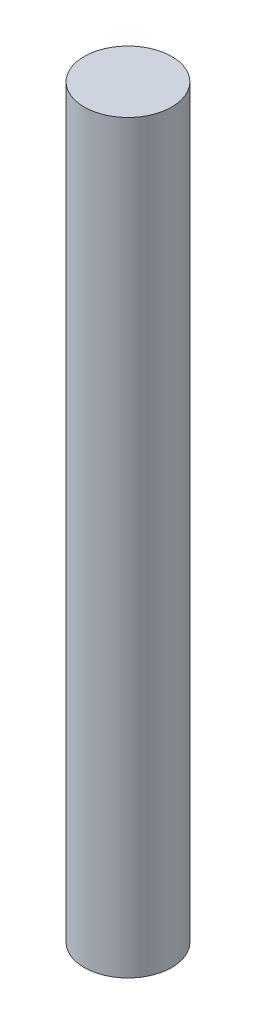
ISO-10303-21;
HEADER;
FILE_DESCRIPTION(('STEP AP214'),'2;1');
FILE_NAME('part.step','',(''),(''),'','','');
FILE_SCHEMA(('AUTOMOTIVE_DESIGN { 1 0 10303 214 1 1 1 1 }'));
ENDSEC;
DATA;
#1=APPLICATION_CONTEXT('core data for automotive mechanical design processes');
#2=APPLICATION_PROTOCOL_DEFINITION('international standard','automotive_design',2000,#1);
#3=PRODUCT_CONTEXT('',#1,'mechanical');
#4=PRODUCT('Part','Part','',(#3));
#5=PRODUCT_RELATED_PRODUCT_CATEGORY('part','',(#4));
#6=PRODUCT_DEFINITION_FORMATION('','',#4);
#7=PRODUCT_DEFINITION_CONTEXT('part definition',#1,'design');
#8=PRODUCT_DEFINITION('design','',#6,#7);
#9=PRODUCT_DEFINITION_SHAPE('','',#8);
#10=(LENGTH_UNIT() NAMED_UNIT(*) SI_UNIT(.MILLI.,.METRE.));
#11=(NAMED_UNIT(*) PLANE_ANGLE_UNIT() SI_UNIT($,.RADIAN.));
#12=(NAMED_UNIT(*) SI_UNIT($,.STERADIAN.) SOLID_ANGLE_UNIT());
#13=UNCERTAINTY_MEASURE_WITH_UNIT(LENGTH_MEASURE(1.E-05),#10,'distance_accuracy_value','');
#14=(GEOMETRIC_REPRESENTATION_CONTEXT(3) GLOBAL_UNCERTAINTY_ASSIGNED_CONTEXT((#13)) GLOBAL_UNIT_ASSIGNED_CONTEXT((#10,
#11,#12)) REPRESENTATION_CONTEXT('',''));
#15=CARTESIAN_POINT('',(0.,0.,0.));
#16=DIRECTION('',(0.,0.,1.));
#17=DIRECTION('',(1.,0.,0.));
#18=AXIS2_PLACEMENT_3D('',#15,#16,#17);
#19=CARTESIAN_POINT('',(0.,0.,0.));
#20=DIRECTION('',(0.,1.,0.));
#21=DIRECTION('',(0.,0.,1.));
#22=AXIS2_PLACEMENT_3D('',#19,#20,#21);
#23=PLANE('',#22);
#24=CARTESIAN_POINT('',(0.,0.,0.));
#25=DIRECTION('',(0.,1.,0.));
#26=DIRECTION('',(0.,0.,1.));
#27=AXIS2_PLACEMENT_3D('',#24,#25,#26);
#28=CIRCLE('',#27,5.875);
#29=CARTESIAN_POINT('',(0.,0.,5.875));
#30=VERTEX_POINT('',#29);
#31=EDGE_CURVE('E11',#30,#30,#28,.T.);
#32=ORIENTED_EDGE('',*,*,#31,.F.);
#33=EDGE_LOOP('',(#32));
#34=FACE_BOUND('',#33,.T.);
#35=CARTESIAN_POINT('',(0.,0.,0.));
#36=DIRECTION('',(0.,1.,0.));
#37=DIRECTION('',(0.,0.,1.));
#38=AXIS2_PLACEMENT_3D('',#35,#36,#37);
#39=CIRCLE('',#38,2.59);
#40=CARTESIAN_POINT('',(-1.5,0.,-2.1114213222377));
#41=VERTEX_POINT('',#40);
#42=CARTESIAN_POINT('',(1.5,0.,-2.1114213222377));
#43=VERTEX_POINT('',#42);
#44=EDGE_CURVE('E65',#41,#43,#39,.T.);
#45=ORIENTED_EDGE('',*,*,#44,.T.);
#46=DIRECTION('',(-1.,0.,0.));
#47=VECTOR('',#46,1.);
#48=CARTESIAN_POINT('',(-1.5,0.,-2.1114213222377));
#49=LINE('',#48,#47);
#50=EDGE_CURVE('E75',#43,#41,#49,.T.);
#51=ORIENTED_EDGE('',*,*,#50,.T.);
#52=EDGE_LOOP('',(#45,#51));
#53=FACE_BOUND('',#52,.T.);
#54=ADVANCED_FACE('F42',(#34,#53),#23,.F.);
#55=CARTESIAN_POINT('',(0.,20.,0.));
#56=DIRECTION('',(0.,-1.,0.));
#57=DIRECTION('',(0.,0.,-1.));
#58=AXIS2_PLACEMENT_3D('',#55,#56,#57);
#59=CYLINDRICAL_SURFACE('',#58,5.875);
#60=ORIENTED_EDGE('',*,*,#31,.T.);
#61=EDGE_LOOP('',(#60));
#62=FACE_BOUND('',#61,.T.);
#63=CARTESIAN_POINT('',(0.,100.,0.));
#64=DIRECTION('',(0.,1.,0.));
#65=DIRECTION('',(0.,0.,1.));
#66=AXIS2_PLACEMENT_3D('',#63,#64,#65);
#67=CIRCLE('',#66,5.875);
#68=CARTESIAN_POINT('',(0.,100.,5.875));
#69=VERTEX_POINT('',#68);
#70=EDGE_CURVE('E91',#69,#69,#67,.T.);
#71=ORIENTED_EDGE('',*,*,#70,.F.);
#72=EDGE_LOOP('',(#71));
#73=FACE_BOUND('',#72,.T.);
#74=ADVANCED_FACE('F44',(#62,#73),#59,.T.);
#75=CARTESIAN_POINT('',(0.,20.,0.));
#76=DIRECTION('',(0.,-1.,0.));
#77=DIRECTION('',(0.,0.,-1.));
#78=AXIS2_PLACEMENT_3D('',#75,#76,#77);
#79=CYLINDRICAL_SURFACE('',#78,2.59);
#80=ORIENTED_EDGE('',*,*,#44,.F.);
#81=DIRECTION('',(0.,-1.,0.));
#82=VECTOR('',#81,1.);
#83=CARTESIAN_POINT('',(-1.5,20.,-2.1114213222377));
#84=LINE('',#83,#82);
#85=CARTESIAN_POINT('',(-1.5,20.,-2.1114213222377));
#86=VERTEX_POINT('',#85);
#87=EDGE_CURVE('E79',#86,#41,#84,.T.);
#88=ORIENTED_EDGE('',*,*,#87,.F.);
#89=CARTESIAN_POINT('',(0.,20.,0.));
#90=DIRECTION('',(0.,1.,0.));
#91=DIRECTION('',(0.,0.,1.));
#92=AXIS2_PLACEMENT_3D('',#89,#90,#91);
#93=CIRCLE('',#92,2.59);
#94=CARTESIAN_POINT('',(1.5,20.,-2.1114213222377));
#95=VERTEX_POINT('',#94);
#96=EDGE_CURVE('E72',#86,#95,#93,.T.);
#97=ORIENTED_EDGE('',*,*,#96,.T.);
#98=DIRECTION('',(0.,-1.,0.));
#99=VECTOR('',#98,1.);
#100=CARTESIAN_POINT('',(1.5,20.,-2.1114213222377));
#101=LINE('',#100,#99);
#102=EDGE_CURVE('E51',#95,#43,#101,.T.);
#103=ORIENTED_EDGE('',*,*,#102,.T.);
#104=EDGE_LOOP('',(#80,#88,#97,#103));
#105=FACE_BOUND('',#104,.T.);
#106=ADVANCED_FACE('F83',(#105),#79,.F.);
#107=CARTESIAN_POINT('',(-1.5,20.,-2.1114213222377));
#108=DIRECTION('',(0.,0.,1.));
#109=DIRECTION('',(1.,0.,0.));
#110=AXIS2_PLACEMENT_3D('',#107,#108,#109);
#111=PLANE('',#110);
#112=ORIENTED_EDGE('',*,*,#50,.F.);
#113=ORIENTED_EDGE('',*,*,#102,.F.);
#114=DIRECTION('',(-1.,0.,0.));
#115=VECTOR('',#114,1.);
#116=CARTESIAN_POINT('',(-1.5,20.,-2.1114213222377));
#117=LINE('',#116,#115);
#118=EDGE_CURVE('E57',#95,#86,#117,.T.);
#119=ORIENTED_EDGE('',*,*,#118,.T.);
#120=ORIENTED_EDGE('',*,*,#87,.T.);
#121=EDGE_LOOP('',(#112,#113,#119,#120));
#122=FACE_BOUND('',#121,.T.);
#123=ADVANCED_FACE('F78',(#122),#111,.T.);
#124=CARTESIAN_POINT('',(0.,20.,0.));
#125=DIRECTION('',(0.,1.,0.));
#126=DIRECTION('',(0.,0.,1.));
#127=AXIS2_PLACEMENT_3D('',#124,#125,#126);
#128=PLANE('',#127);
#129=ORIENTED_EDGE('',*,*,#118,.F.);
#130=ORIENTED_EDGE('',*,*,#96,.F.);
#131=EDGE_LOOP('',(#129,#130));
#132=FACE_BOUND('',#131,.T.);
#133=ADVANCED_FACE('F73',(#132),#128,.F.);
#134=CARTESIAN_POINT('',(0.,100.,0.));
#135=DIRECTION('',(0.,1.,0.));
#136=DIRECTION('',(0.,0.,1.));
#137=AXIS2_PLACEMENT_3D('',#134,#135,#136);
#138=PLANE('',#137);
#139=ORIENTED_EDGE('',*,*,#70,.T.);
#140=EDGE_LOOP('',(#139));
#141=FACE_BOUND('',#140,.T.);
#142=ADVANCED_FACE('F97',(#141),#138,.T.);
#143=CLOSED_SHELL('',(#54,#74,#106,#123,#133,#142));
#144=MANIFOLD_SOLID_BREP('B2',#143);
#145=ADVANCED_BREP_SHAPE_REPRESENTATION('',(#18,#144),#14);
#146=SHAPE_DEFINITION_REPRESENTATION(#9,#145);
ENDSEC;
END-ISO-10303-21;
